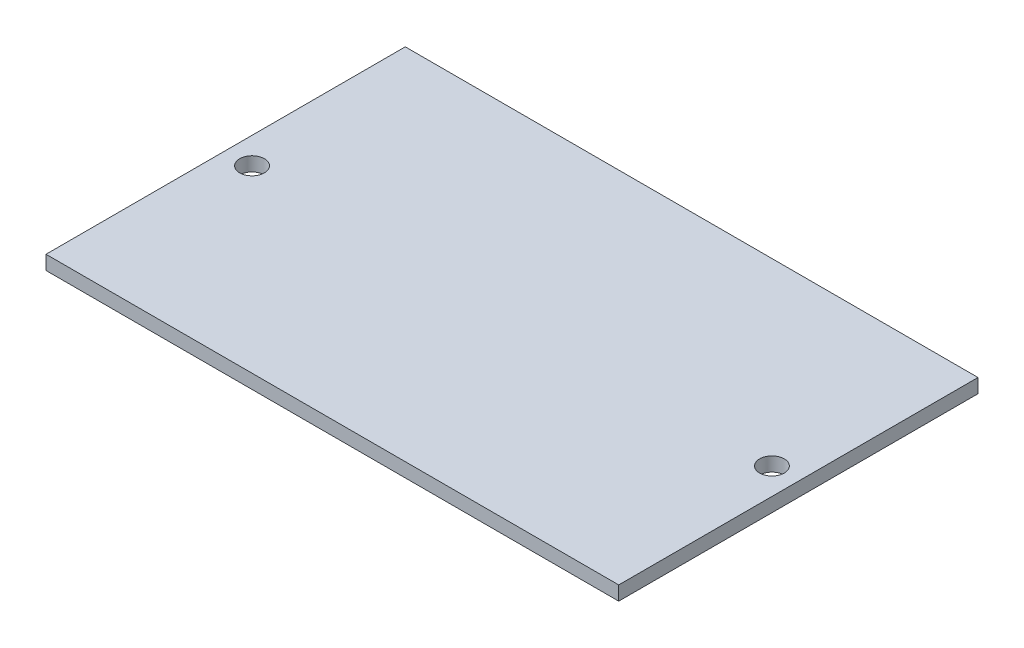
ISO-10303-21;
HEADER;
FILE_DESCRIPTION(('STEP AP214'),'2;1');
FILE_NAME('part.step','',(''),(''),'','','');
FILE_SCHEMA(('AUTOMOTIVE_DESIGN { 1 0 10303 214 1 1 1 1 }'));
ENDSEC;
DATA;
#1=APPLICATION_CONTEXT('core data for automotive mechanical design processes');
#2=APPLICATION_PROTOCOL_DEFINITION('international standard','automotive_design',2000,#1);
#3=PRODUCT_CONTEXT('',#1,'mechanical');
#4=PRODUCT('Part','Part','',(#3));
#5=PRODUCT_RELATED_PRODUCT_CATEGORY('part','',(#4));
#6=PRODUCT_DEFINITION_FORMATION('','',#4);
#7=PRODUCT_DEFINITION_CONTEXT('part definition',#1,'design');
#8=PRODUCT_DEFINITION('design','',#6,#7);
#9=PRODUCT_DEFINITION_SHAPE('','',#8);
#10=(LENGTH_UNIT() NAMED_UNIT(*) SI_UNIT(.MILLI.,.METRE.));
#11=(NAMED_UNIT(*) PLANE_ANGLE_UNIT() SI_UNIT($,.RADIAN.));
#12=(NAMED_UNIT(*) SI_UNIT($,.STERADIAN.) SOLID_ANGLE_UNIT());
#13=UNCERTAINTY_MEASURE_WITH_UNIT(LENGTH_MEASURE(1.E-05),#10,'distance_accuracy_value','');
#14=(GEOMETRIC_REPRESENTATION_CONTEXT(3) GLOBAL_UNCERTAINTY_ASSIGNED_CONTEXT((#13)) GLOBAL_UNIT_ASSIGNED_CONTEXT((#10,
#11,#12)) REPRESENTATION_CONTEXT('',''));
#15=CARTESIAN_POINT('',(0.,0.,0.));
#16=DIRECTION('',(0.,0.,1.));
#17=DIRECTION('',(1.,0.,0.));
#18=AXIS2_PLACEMENT_3D('',#15,#16,#17);
#19=CARTESIAN_POINT('',(-40.65,2.,25.5));
#20=DIRECTION('',(1.,0.,0.));
#21=DIRECTION('',(0.,0.,-1.));
#22=AXIS2_PLACEMENT_3D('',#19,#20,#21);
#23=PLANE('',#22);
#24=DIRECTION('',(0.,0.,1.));
#25=VECTOR('',#24,1.);
#26=CARTESIAN_POINT('',(-40.65,0.,25.5));
#27=LINE('',#26,#25);
#28=CARTESIAN_POINT('',(-40.65,0.,-25.5));
#29=VERTEX_POINT('',#28);
#30=CARTESIAN_POINT('',(-40.65,0.,25.5));
#31=VERTEX_POINT('',#30);
#32=EDGE_CURVE('E107',#29,#31,#27,.T.);
#33=ORIENTED_EDGE('',*,*,#32,.T.);
#34=DIRECTION('',(0.,-1.,0.));
#35=VECTOR('',#34,1.);
#36=CARTESIAN_POINT('',(-40.65,2.,25.5));
#37=LINE('',#36,#35);
#38=CARTESIAN_POINT('',(-40.65,2.,25.5));
#39=VERTEX_POINT('',#38);
#40=EDGE_CURVE('E11',#39,#31,#37,.T.);
#41=ORIENTED_EDGE('',*,*,#40,.F.);
#42=DIRECTION('',(0.,0.,1.));
#43=VECTOR('',#42,1.);
#44=CARTESIAN_POINT('',(-40.65,2.,25.5));
#45=LINE('',#44,#43);
#46=CARTESIAN_POINT('',(-40.65,2.,-25.5));
#47=VERTEX_POINT('',#46);
#48=EDGE_CURVE('E91',#47,#39,#45,.T.);
#49=ORIENTED_EDGE('',*,*,#48,.F.);
#50=DIRECTION('',(0.,-1.,0.));
#51=VECTOR('',#50,1.);
#52=CARTESIAN_POINT('',(-40.65,2.,-25.5));
#53=LINE('',#52,#51);
#54=EDGE_CURVE('E103',#47,#29,#53,.T.);
#55=ORIENTED_EDGE('',*,*,#54,.T.);
#56=EDGE_LOOP('',(#33,#41,#49,#55));
#57=FACE_BOUND('',#56,.T.);
#58=ADVANCED_FACE('F39',(#57),#23,.F.);
#59=CARTESIAN_POINT('',(40.65,2.,25.5));
#60=DIRECTION('',(0.,0.,-1.));
#61=DIRECTION('',(-1.,0.,0.));
#62=AXIS2_PLACEMENT_3D('',#59,#60,#61);
#63=PLANE('',#62);
#64=DIRECTION('',(1.,0.,0.));
#65=VECTOR('',#64,1.);
#66=CARTESIAN_POINT('',(40.65,0.,25.5));
#67=LINE('',#66,#65);
#68=CARTESIAN_POINT('',(40.65,0.,25.5));
#69=VERTEX_POINT('',#68);
#70=EDGE_CURVE('E96',#31,#69,#67,.T.);
#71=ORIENTED_EDGE('',*,*,#70,.T.);
#72=DIRECTION('',(0.,-1.,0.));
#73=VECTOR('',#72,1.);
#74=CARTESIAN_POINT('',(40.65,2.,25.5));
#75=LINE('',#74,#73);
#76=CARTESIAN_POINT('',(40.65,2.,25.5));
#77=VERTEX_POINT('',#76);
#78=EDGE_CURVE('E48',#77,#69,#75,.T.);
#79=ORIENTED_EDGE('',*,*,#78,.F.);
#80=DIRECTION('',(1.,0.,0.));
#81=VECTOR('',#80,1.);
#82=CARTESIAN_POINT('',(40.65,2.,25.5));
#83=LINE('',#82,#81);
#84=EDGE_CURVE('E86',#39,#77,#83,.T.);
#85=ORIENTED_EDGE('',*,*,#84,.F.);
#86=ORIENTED_EDGE('',*,*,#40,.T.);
#87=EDGE_LOOP('',(#71,#79,#85,#86));
#88=FACE_BOUND('',#87,.T.);
#89=ADVANCED_FACE('F95',(#88),#63,.F.);
#90=CARTESIAN_POINT('',(40.65,2.,25.5));
#91=DIRECTION('',(-1.,0.,0.));
#92=DIRECTION('',(0.,0.,1.));
#93=AXIS2_PLACEMENT_3D('',#90,#91,#92);
#94=PLANE('',#93);
#95=DIRECTION('',(0.,0.,-1.));
#96=VECTOR('',#95,1.);
#97=CARTESIAN_POINT('',(40.65,0.,25.5));
#98=LINE('',#97,#96);
#99=CARTESIAN_POINT('',(40.65,0.,-25.5));
#100=VERTEX_POINT('',#99);
#101=EDGE_CURVE('E73',#69,#100,#98,.T.);
#102=ORIENTED_EDGE('',*,*,#101,.T.);
#103=DIRECTION('',(0.,-1.,0.));
#104=VECTOR('',#103,1.);
#105=CARTESIAN_POINT('',(40.65,2.,-25.5));
#106=LINE('',#105,#104);
#107=CARTESIAN_POINT('',(40.65,2.,-25.5));
#108=VERTEX_POINT('',#107);
#109=EDGE_CURVE('E98',#108,#100,#106,.T.);
#110=ORIENTED_EDGE('',*,*,#109,.F.);
#111=DIRECTION('',(0.,0.,-1.));
#112=VECTOR('',#111,1.);
#113=CARTESIAN_POINT('',(40.65,2.,25.5));
#114=LINE('',#113,#112);
#115=EDGE_CURVE('E89',#77,#108,#114,.T.);
#116=ORIENTED_EDGE('',*,*,#115,.F.);
#117=ORIENTED_EDGE('',*,*,#78,.T.);
#118=EDGE_LOOP('',(#102,#110,#116,#117));
#119=FACE_BOUND('',#118,.T.);
#120=ADVANCED_FACE('F99',(#119),#94,.F.);
#121=CARTESIAN_POINT('',(40.65,2.,-25.5));
#122=DIRECTION('',(0.,0.,1.));
#123=DIRECTION('',(1.,0.,0.));
#124=AXIS2_PLACEMENT_3D('',#121,#122,#123);
#125=PLANE('',#124);
#126=DIRECTION('',(-1.,0.,0.));
#127=VECTOR('',#126,1.);
#128=CARTESIAN_POINT('',(40.65,0.,-25.5));
#129=LINE('',#128,#127);
#130=EDGE_CURVE('E79',#100,#29,#129,.T.);
#131=ORIENTED_EDGE('',*,*,#130,.T.);
#132=ORIENTED_EDGE('',*,*,#54,.F.);
#133=DIRECTION('',(-1.,0.,0.));
#134=VECTOR('',#133,1.);
#135=CARTESIAN_POINT('',(40.65,2.,-25.5));
#136=LINE('',#135,#134);
#137=EDGE_CURVE('E56',#108,#47,#136,.T.);
#138=ORIENTED_EDGE('',*,*,#137,.F.);
#139=ORIENTED_EDGE('',*,*,#109,.T.);
#140=EDGE_LOOP('',(#131,#132,#138,#139));
#141=FACE_BOUND('',#140,.T.);
#142=ADVANCED_FACE('F121',(#141),#125,.F.);
#143=CARTESIAN_POINT('',(0.,2.,0.));
#144=DIRECTION('',(0.,1.,0.));
#145=DIRECTION('',(0.,0.,1.));
#146=AXIS2_PLACEMENT_3D('',#143,#144,#145);
#147=PLANE('',#146);
#148=CARTESIAN_POINT('',(-36.9,2.,0.));
#149=DIRECTION('',(0.,1.,0.));
#150=DIRECTION('',(0.,0.,1.));
#151=AXIS2_PLACEMENT_3D('',#148,#149,#150);
#152=CIRCLE('',#151,1.75);
#153=CARTESIAN_POINT('',(-36.9,2.,1.75000000000001));
#154=VERTEX_POINT('',#153);
#155=EDGE_CURVE('E132',#154,#154,#152,.T.);
#156=ORIENTED_EDGE('',*,*,#155,.F.);
#157=EDGE_LOOP('',(#156));
#158=FACE_BOUND('',#157,.T.);
#159=CARTESIAN_POINT('',(36.9,2.,-2.40303044613273E-13));
#160=DIRECTION('',(0.,1.,0.));
#161=DIRECTION('',(0.,0.,-1.));
#162=AXIS2_PLACEMENT_3D('',#159,#160,#161);
#163=CIRCLE('',#162,1.75);
#164=CARTESIAN_POINT('',(36.9,2.,-1.75000000000024));
#165=VERTEX_POINT('',#164);
#166=EDGE_CURVE('E133',#165,#165,#163,.T.);
#167=ORIENTED_EDGE('',*,*,#166,.F.);
#168=EDGE_LOOP('',(#167));
#169=FACE_BOUND('',#168,.T.);
#170=ORIENTED_EDGE('',*,*,#48,.T.);
#171=ORIENTED_EDGE('',*,*,#84,.T.);
#172=ORIENTED_EDGE('',*,*,#115,.T.);
#173=ORIENTED_EDGE('',*,*,#137,.T.);
#174=EDGE_LOOP('',(#170,#171,#172,#173));
#175=FACE_BOUND('',#174,.T.);
#176=ADVANCED_FACE('F87',(#158,#169,#175),#147,.T.);
#177=CARTESIAN_POINT('',(0.,0.,0.));
#178=DIRECTION('',(0.,1.,0.));
#179=DIRECTION('',(0.,0.,1.));
#180=AXIS2_PLACEMENT_3D('',#177,#178,#179);
#181=PLANE('',#180);
#182=CARTESIAN_POINT('',(-36.9,0.,0.));
#183=DIRECTION('',(0.,1.,0.));
#184=DIRECTION('',(0.,0.,1.));
#185=AXIS2_PLACEMENT_3D('',#182,#183,#184);
#186=CIRCLE('',#185,1.75);
#187=CARTESIAN_POINT('',(-36.9,0.,1.75000000000001));
#188=VERTEX_POINT('',#187);
#189=EDGE_CURVE('E111',#188,#188,#186,.F.);
#190=ORIENTED_EDGE('',*,*,#189,.F.);
#191=EDGE_LOOP('',(#190));
#192=FACE_BOUND('',#191,.T.);
#193=CARTESIAN_POINT('',(36.9,0.,-2.40303044613273E-13));
#194=DIRECTION('',(0.,1.,0.));
#195=DIRECTION('',(0.,0.,1.));
#196=AXIS2_PLACEMENT_3D('',#193,#194,#195);
#197=CIRCLE('',#196,1.75);
#198=CARTESIAN_POINT('',(36.9,0.,1.74999999999976));
#199=VERTEX_POINT('',#198);
#200=EDGE_CURVE('E128',#199,#199,#197,.F.);
#201=ORIENTED_EDGE('',*,*,#200,.F.);
#202=EDGE_LOOP('',(#201));
#203=FACE_BOUND('',#202,.T.);
#204=ORIENTED_EDGE('',*,*,#32,.F.);
#205=ORIENTED_EDGE('',*,*,#130,.F.);
#206=ORIENTED_EDGE('',*,*,#101,.F.);
#207=ORIENTED_EDGE('',*,*,#70,.F.);
#208=EDGE_LOOP('',(#204,#205,#206,#207));
#209=FACE_BOUND('',#208,.T.);
#210=ADVANCED_FACE('F124',(#192,#203,#209),#181,.F.);
#211=CARTESIAN_POINT('',(36.9,-4.94974746830584,-2.40303044613273E-13));
#212=DIRECTION('',(0.,1.,0.));
#213=DIRECTION('',(0.,0.,1.));
#214=AXIS2_PLACEMENT_3D('',#211,#212,#213);
#215=CYLINDRICAL_SURFACE('',#214,1.75);
#216=ORIENTED_EDGE('',*,*,#200,.T.);
#217=EDGE_LOOP('',(#216));
#218=FACE_BOUND('',#217,.T.);
#219=ORIENTED_EDGE('',*,*,#166,.T.);
#220=EDGE_LOOP('',(#219));
#221=FACE_BOUND('',#220,.T.);
#222=ADVANCED_FACE('F151',(#218,#221),#215,.F.);
#223=CARTESIAN_POINT('',(-36.9,-4.94974746830584,0.));
#224=DIRECTION('',(0.,1.,0.));
#225=DIRECTION('',(0.,0.,1.));
#226=AXIS2_PLACEMENT_3D('',#223,#224,#225);
#227=CYLINDRICAL_SURFACE('',#226,1.75);
#228=ORIENTED_EDGE('',*,*,#189,.T.);
#229=EDGE_LOOP('',(#228));
#230=FACE_BOUND('',#229,.T.);
#231=ORIENTED_EDGE('',*,*,#155,.T.);
#232=EDGE_LOOP('',(#231));
#233=FACE_BOUND('',#232,.T.);
#234=ADVANCED_FACE('F144',(#230,#233),#227,.F.);
#235=CLOSED_SHELL('',(#58,#89,#120,#142,#176,#210,#222,#234));
#236=MANIFOLD_SOLID_BREP('B2',#235);
#237=ADVANCED_BREP_SHAPE_REPRESENTATION('',(#18,#236),#14);
#238=SHAPE_DEFINITION_REPRESENTATION(#9,#237);
ENDSEC;
END-ISO-10303-21;
